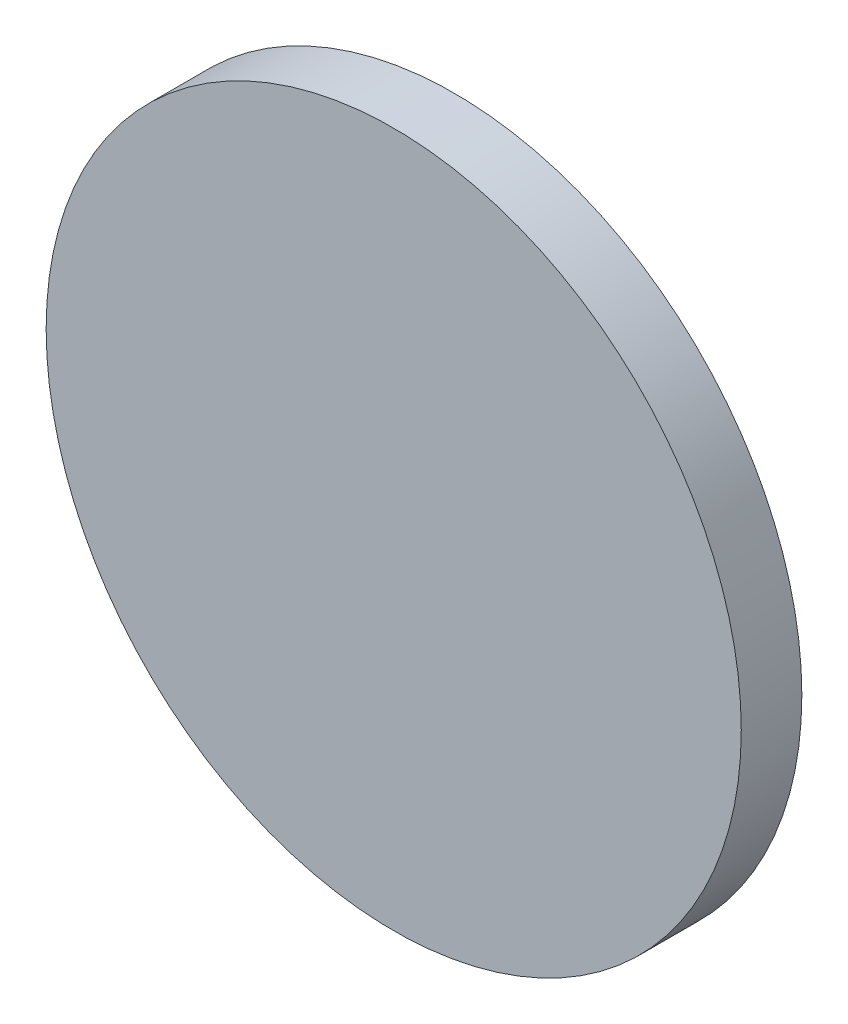
ISO-10303-21;
HEADER;
FILE_DESCRIPTION(('STEP AP214'),'2;1');
FILE_NAME('part.step','',(''),(''),'','','');
FILE_SCHEMA(('AUTOMOTIVE_DESIGN { 1 0 10303 214 1 1 1 1 }'));
ENDSEC;
DATA;
#1=APPLICATION_CONTEXT('core data for automotive mechanical design processes');
#2=APPLICATION_PROTOCOL_DEFINITION('international standard','automotive_design',2000,#1);
#3=PRODUCT_CONTEXT('',#1,'mechanical');
#4=PRODUCT('Part','Part','',(#3));
#5=PRODUCT_RELATED_PRODUCT_CATEGORY('part','',(#4));
#6=PRODUCT_DEFINITION_FORMATION('','',#4);
#7=PRODUCT_DEFINITION_CONTEXT('part definition',#1,'design');
#8=PRODUCT_DEFINITION('design','',#6,#7);
#9=PRODUCT_DEFINITION_SHAPE('','',#8);
#10=(LENGTH_UNIT() NAMED_UNIT(*) SI_UNIT(.MILLI.,.METRE.));
#11=(NAMED_UNIT(*) PLANE_ANGLE_UNIT() SI_UNIT($,.RADIAN.));
#12=(NAMED_UNIT(*) SI_UNIT($,.STERADIAN.) SOLID_ANGLE_UNIT());
#13=UNCERTAINTY_MEASURE_WITH_UNIT(LENGTH_MEASURE(1.E-05),#10,'distance_accuracy_value','');
#14=(GEOMETRIC_REPRESENTATION_CONTEXT(3) GLOBAL_UNCERTAINTY_ASSIGNED_CONTEXT((#13)) GLOBAL_UNIT_ASSIGNED_CONTEXT((#10,
#11,#12)) REPRESENTATION_CONTEXT('',''));
#15=CARTESIAN_POINT('',(0.,0.,0.));
#16=DIRECTION('',(0.,0.,1.));
#17=DIRECTION('',(1.,0.,0.));
#18=AXIS2_PLACEMENT_3D('',#15,#16,#17);
#19=CARTESIAN_POINT('',(0.,0.,-10.));
#20=DIRECTION('',(0.,0.,1.));
#21=DIRECTION('',(1.,0.,0.));
#22=AXIS2_PLACEMENT_3D('',#19,#20,#21);
#23=CYLINDRICAL_SURFACE('',#22,57.3785000000004);
#24=CARTESIAN_POINT('',(0.,0.,-10.));
#25=DIRECTION('',(0.,0.,1.));
#26=DIRECTION('',(1.,0.,0.));
#27=AXIS2_PLACEMENT_3D('',#24,#25,#26);
#28=CIRCLE('',#27,57.3785000000004);
#29=CARTESIAN_POINT('',(57.3785000000004,0.,-10.));
#30=VERTEX_POINT('',#29);
#31=EDGE_CURVE('E10',#30,#30,#28,.T.);
#32=ORIENTED_EDGE('',*,*,#31,.T.);
#33=EDGE_LOOP('',(#32));
#34=FACE_BOUND('',#33,.T.);
#35=CARTESIAN_POINT('',(0.,0.,0.));
#36=DIRECTION('',(0.,0.,1.));
#37=DIRECTION('',(1.,0.,0.));
#38=AXIS2_PLACEMENT_3D('',#35,#36,#37);
#39=CIRCLE('',#38,57.3785000000004);
#40=CARTESIAN_POINT('',(57.3785000000004,0.,0.));
#41=VERTEX_POINT('',#40);
#42=EDGE_CURVE('E34',#41,#41,#39,.T.);
#43=ORIENTED_EDGE('',*,*,#42,.F.);
#44=EDGE_LOOP('',(#43));
#45=FACE_BOUND('',#44,.T.);
#46=ADVANCED_FACE('F31',(#34,#45),#23,.T.);
#47=CARTESIAN_POINT('',(0.,0.,-10.));
#48=DIRECTION('',(0.,0.,1.));
#49=DIRECTION('',(1.,0.,0.));
#50=AXIS2_PLACEMENT_3D('',#47,#48,#49);
#51=PLANE('',#50);
#52=ORIENTED_EDGE('',*,*,#31,.F.);
#53=EDGE_LOOP('',(#52));
#54=FACE_BOUND('',#53,.T.);
#55=ADVANCED_FACE('F46',(#54),#51,.F.);
#56=CARTESIAN_POINT('',(0.,0.,0.));
#57=DIRECTION('',(0.,0.,1.));
#58=DIRECTION('',(1.,0.,0.));
#59=AXIS2_PLACEMENT_3D('',#56,#57,#58);
#60=PLANE('',#59);
#61=ORIENTED_EDGE('',*,*,#42,.T.);
#62=EDGE_LOOP('',(#61));
#63=FACE_BOUND('',#62,.T.);
#64=ADVANCED_FACE('F43',(#63),#60,.T.);
#65=CLOSED_SHELL('',(#46,#55,#64));
#66=MANIFOLD_SOLID_BREP('B2',#65);
#67=ADVANCED_BREP_SHAPE_REPRESENTATION('',(#18,#66),#14);
#68=SHAPE_DEFINITION_REPRESENTATION(#9,#67);
ENDSEC;
END-ISO-10303-21;
